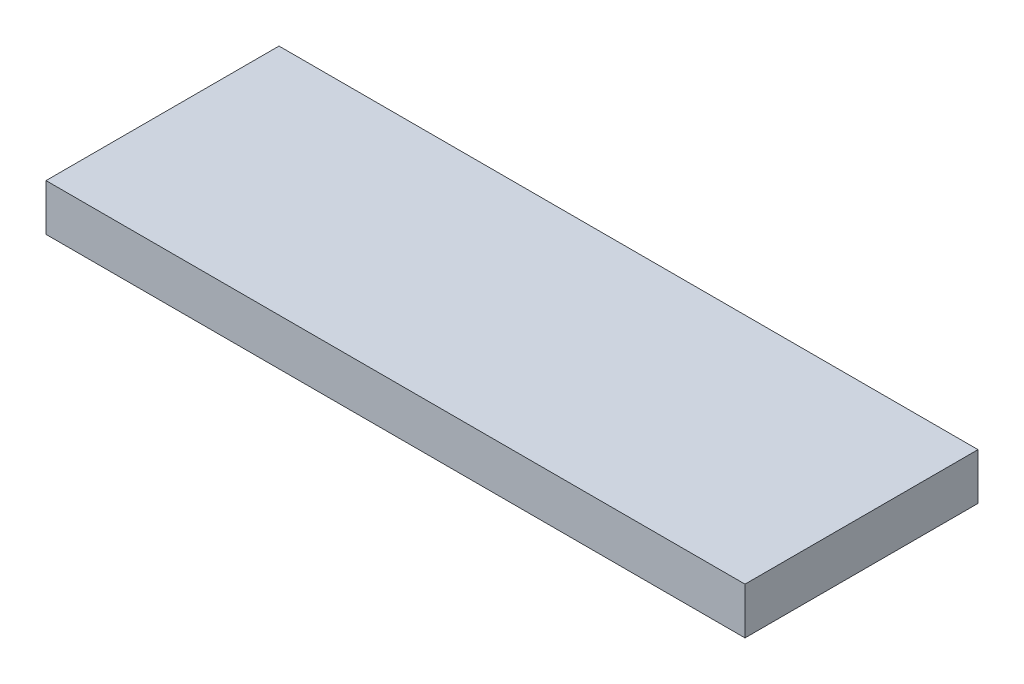
ISO-10303-21;
HEADER;
FILE_DESCRIPTION(('STEP AP214'),'2;1');
FILE_NAME('part.step','',(''),(''),'','','');
FILE_SCHEMA(('AUTOMOTIVE_DESIGN { 1 0 10303 214 1 1 1 1 }'));
ENDSEC;
DATA;
#1=APPLICATION_CONTEXT('core data for automotive mechanical design processes');
#2=APPLICATION_PROTOCOL_DEFINITION('international standard','automotive_design',2000,#1);
#3=PRODUCT_CONTEXT('',#1,'mechanical');
#4=PRODUCT('Part','Part','',(#3));
#5=PRODUCT_RELATED_PRODUCT_CATEGORY('part','',(#4));
#6=PRODUCT_DEFINITION_FORMATION('','',#4);
#7=PRODUCT_DEFINITION_CONTEXT('part definition',#1,'design');
#8=PRODUCT_DEFINITION('design','',#6,#7);
#9=PRODUCT_DEFINITION_SHAPE('','',#8);
#10=(LENGTH_UNIT() NAMED_UNIT(*) SI_UNIT(.MILLI.,.METRE.));
#11=(NAMED_UNIT(*) PLANE_ANGLE_UNIT() SI_UNIT($,.RADIAN.));
#12=(NAMED_UNIT(*) SI_UNIT($,.STERADIAN.) SOLID_ANGLE_UNIT());
#13=UNCERTAINTY_MEASURE_WITH_UNIT(LENGTH_MEASURE(1.E-05),#10,'distance_accuracy_value','');
#14=(GEOMETRIC_REPRESENTATION_CONTEXT(3) GLOBAL_UNCERTAINTY_ASSIGNED_CONTEXT((#13)) GLOBAL_UNIT_ASSIGNED_CONTEXT((#10,
#11,#12)) REPRESENTATION_CONTEXT('',''));
#15=CARTESIAN_POINT('',(0.,0.,0.));
#16=DIRECTION('',(0.,0.,1.));
#17=DIRECTION('',(1.,0.,0.));
#18=AXIS2_PLACEMENT_3D('',#15,#16,#17);
#19=CARTESIAN_POINT('',(-75.,10.,25.));
#20=DIRECTION('',(1.,0.,0.));
#21=DIRECTION('',(0.,0.,-1.));
#22=AXIS2_PLACEMENT_3D('',#19,#20,#21);
#23=PLANE('',#22);
#24=DIRECTION('',(0.,0.,1.));
#25=VECTOR('',#24,1.);
#26=CARTESIAN_POINT('',(-75.,0.,25.));
#27=LINE('',#26,#25);
#28=CARTESIAN_POINT('',(-75.,0.,-25.));
#29=VERTEX_POINT('',#28);
#30=CARTESIAN_POINT('',(-75.,0.,25.));
#31=VERTEX_POINT('',#30);
#32=EDGE_CURVE('E96',#29,#31,#27,.T.);
#33=ORIENTED_EDGE('',*,*,#32,.T.);
#34=DIRECTION('',(0.,-1.,0.));
#35=VECTOR('',#34,1.);
#36=CARTESIAN_POINT('',(-75.,10.,25.));
#37=LINE('',#36,#35);
#38=CARTESIAN_POINT('',(-75.,10.,25.));
#39=VERTEX_POINT('',#38);
#40=EDGE_CURVE('E11',#39,#31,#37,.T.);
#41=ORIENTED_EDGE('',*,*,#40,.F.);
#42=DIRECTION('',(0.,0.,1.));
#43=VECTOR('',#42,1.);
#44=CARTESIAN_POINT('',(-75.,10.,25.));
#45=LINE('',#44,#43);
#46=CARTESIAN_POINT('',(-75.,10.,-25.));
#47=VERTEX_POINT('',#46);
#48=EDGE_CURVE('E84',#47,#39,#45,.T.);
#49=ORIENTED_EDGE('',*,*,#48,.F.);
#50=DIRECTION('',(0.,-1.,0.));
#51=VECTOR('',#50,1.);
#52=CARTESIAN_POINT('',(-75.,10.,-25.));
#53=LINE('',#52,#51);
#54=EDGE_CURVE('E92',#47,#29,#53,.T.);
#55=ORIENTED_EDGE('',*,*,#54,.T.);
#56=EDGE_LOOP('',(#33,#41,#49,#55));
#57=FACE_BOUND('',#56,.T.);
#58=ADVANCED_FACE('F33',(#57),#23,.F.);
#59=CARTESIAN_POINT('',(75.,10.,25.));
#60=DIRECTION('',(0.,0.,-1.));
#61=DIRECTION('',(-1.,0.,0.));
#62=AXIS2_PLACEMENT_3D('',#59,#60,#61);
#63=PLANE('',#62);
#64=DIRECTION('',(1.,0.,0.));
#65=VECTOR('',#64,1.);
#66=CARTESIAN_POINT('',(75.,0.,25.));
#67=LINE('',#66,#65);
#68=CARTESIAN_POINT('',(75.,0.,25.));
#69=VERTEX_POINT('',#68);
#70=EDGE_CURVE('E88',#31,#69,#67,.T.);
#71=ORIENTED_EDGE('',*,*,#70,.T.);
#72=DIRECTION('',(0.,-1.,0.));
#73=VECTOR('',#72,1.);
#74=CARTESIAN_POINT('',(75.,10.,25.));
#75=LINE('',#74,#73);
#76=CARTESIAN_POINT('',(75.,10.,25.));
#77=VERTEX_POINT('',#76);
#78=EDGE_CURVE('E41',#77,#69,#75,.T.);
#79=ORIENTED_EDGE('',*,*,#78,.F.);
#80=DIRECTION('',(1.,0.,0.));
#81=VECTOR('',#80,1.);
#82=CARTESIAN_POINT('',(75.,10.,25.));
#83=LINE('',#82,#81);
#84=EDGE_CURVE('E79',#39,#77,#83,.T.);
#85=ORIENTED_EDGE('',*,*,#84,.F.);
#86=ORIENTED_EDGE('',*,*,#40,.T.);
#87=EDGE_LOOP('',(#71,#79,#85,#86));
#88=FACE_BOUND('',#87,.T.);
#89=ADVANCED_FACE('F87',(#88),#63,.F.);
#90=CARTESIAN_POINT('',(75.,10.,25.));
#91=DIRECTION('',(-1.,0.,0.));
#92=DIRECTION('',(0.,0.,1.));
#93=AXIS2_PLACEMENT_3D('',#90,#91,#92);
#94=PLANE('',#93);
#95=DIRECTION('',(0.,0.,-1.));
#96=VECTOR('',#95,1.);
#97=CARTESIAN_POINT('',(75.,0.,25.));
#98=LINE('',#97,#96);
#99=CARTESIAN_POINT('',(75.,0.,-25.));
#100=VERTEX_POINT('',#99);
#101=EDGE_CURVE('E66',#69,#100,#98,.T.);
#102=ORIENTED_EDGE('',*,*,#101,.T.);
#103=DIRECTION('',(0.,-1.,0.));
#104=VECTOR('',#103,1.);
#105=CARTESIAN_POINT('',(75.,10.,-25.));
#106=LINE('',#105,#104);
#107=CARTESIAN_POINT('',(75.,10.,-25.));
#108=VERTEX_POINT('',#107);
#109=EDGE_CURVE('E89',#108,#100,#106,.T.);
#110=ORIENTED_EDGE('',*,*,#109,.F.);
#111=DIRECTION('',(0.,0.,-1.));
#112=VECTOR('',#111,1.);
#113=CARTESIAN_POINT('',(75.,10.,25.));
#114=LINE('',#113,#112);
#115=EDGE_CURVE('E82',#77,#108,#114,.T.);
#116=ORIENTED_EDGE('',*,*,#115,.F.);
#117=ORIENTED_EDGE('',*,*,#78,.T.);
#118=EDGE_LOOP('',(#102,#110,#116,#117));
#119=FACE_BOUND('',#118,.T.);
#120=ADVANCED_FACE('F90',(#119),#94,.F.);
#121=CARTESIAN_POINT('',(75.,10.,-25.));
#122=DIRECTION('',(0.,0.,1.));
#123=DIRECTION('',(1.,0.,0.));
#124=AXIS2_PLACEMENT_3D('',#121,#122,#123);
#125=PLANE('',#124);
#126=DIRECTION('',(-1.,0.,0.));
#127=VECTOR('',#126,1.);
#128=CARTESIAN_POINT('',(75.,0.,-25.));
#129=LINE('',#128,#127);
#130=EDGE_CURVE('E72',#100,#29,#129,.T.);
#131=ORIENTED_EDGE('',*,*,#130,.T.);
#132=ORIENTED_EDGE('',*,*,#54,.F.);
#133=DIRECTION('',(-1.,0.,0.));
#134=VECTOR('',#133,1.);
#135=CARTESIAN_POINT('',(75.,10.,-25.));
#136=LINE('',#135,#134);
#137=EDGE_CURVE('E49',#108,#47,#136,.T.);
#138=ORIENTED_EDGE('',*,*,#137,.F.);
#139=ORIENTED_EDGE('',*,*,#109,.T.);
#140=EDGE_LOOP('',(#131,#132,#138,#139));
#141=FACE_BOUND('',#140,.T.);
#142=ADVANCED_FACE('F103',(#141),#125,.F.);
#143=CARTESIAN_POINT('',(0.,10.,0.));
#144=DIRECTION('',(0.,1.,0.));
#145=DIRECTION('',(0.,0.,1.));
#146=AXIS2_PLACEMENT_3D('',#143,#144,#145);
#147=PLANE('',#146);
#148=ORIENTED_EDGE('',*,*,#48,.T.);
#149=ORIENTED_EDGE('',*,*,#84,.T.);
#150=ORIENTED_EDGE('',*,*,#115,.T.);
#151=ORIENTED_EDGE('',*,*,#137,.T.);
#152=EDGE_LOOP('',(#148,#149,#150,#151));
#153=FACE_BOUND('',#152,.T.);
#154=ADVANCED_FACE('F80',(#153),#147,.T.);
#155=CARTESIAN_POINT('',(0.,0.,0.));
#156=DIRECTION('',(0.,1.,0.));
#157=DIRECTION('',(0.,0.,1.));
#158=AXIS2_PLACEMENT_3D('',#155,#156,#157);
#159=PLANE('',#158);
#160=ORIENTED_EDGE('',*,*,#32,.F.);
#161=ORIENTED_EDGE('',*,*,#130,.F.);
#162=ORIENTED_EDGE('',*,*,#101,.F.);
#163=ORIENTED_EDGE('',*,*,#70,.F.);
#164=EDGE_LOOP('',(#160,#161,#162,#163));
#165=FACE_BOUND('',#164,.T.);
#166=ADVANCED_FACE('F106',(#165),#159,.F.);
#167=CLOSED_SHELL('',(#58,#89,#120,#142,#154,#166));
#168=MANIFOLD_SOLID_BREP('B2',#167);
#169=ADVANCED_BREP_SHAPE_REPRESENTATION('',(#18,#168),#14);
#170=SHAPE_DEFINITION_REPRESENTATION(#9,#169);
ENDSEC;
END-ISO-10303-21;
